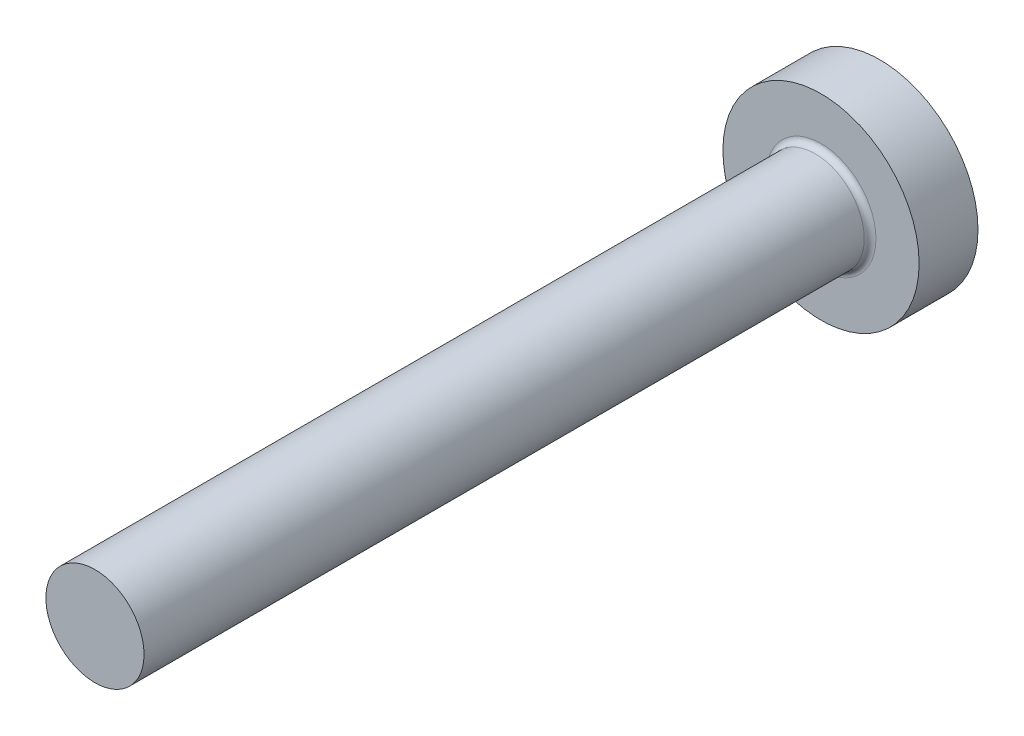
ISO-10303-21;
HEADER;
FILE_DESCRIPTION(('STEP AP214'),'2;1');
FILE_NAME('part.step','',(''),(''),'','','');
FILE_SCHEMA(('AUTOMOTIVE_DESIGN { 1 0 10303 214 1 1 1 1 }'));
ENDSEC;
DATA;
#1=APPLICATION_CONTEXT('core data for automotive mechanical design processes');
#2=APPLICATION_PROTOCOL_DEFINITION('international standard','automotive_design',2000,#1);
#3=PRODUCT_CONTEXT('',#1,'mechanical');
#4=PRODUCT('Part','Part','',(#3));
#5=PRODUCT_RELATED_PRODUCT_CATEGORY('part','',(#4));
#6=PRODUCT_DEFINITION_FORMATION('','',#4);
#7=PRODUCT_DEFINITION_CONTEXT('part definition',#1,'design');
#8=PRODUCT_DEFINITION('design','',#6,#7);
#9=PRODUCT_DEFINITION_SHAPE('','',#8);
#10=(LENGTH_UNIT() NAMED_UNIT(*) SI_UNIT(.MILLI.,.METRE.));
#11=(NAMED_UNIT(*) PLANE_ANGLE_UNIT() SI_UNIT($,.RADIAN.));
#12=(NAMED_UNIT(*) SI_UNIT($,.STERADIAN.) SOLID_ANGLE_UNIT());
#13=UNCERTAINTY_MEASURE_WITH_UNIT(LENGTH_MEASURE(1.E-05),#10,'distance_accuracy_value','');
#14=(GEOMETRIC_REPRESENTATION_CONTEXT(3) GLOBAL_UNCERTAINTY_ASSIGNED_CONTEXT((#13)) GLOBAL_UNIT_ASSIGNED_CONTEXT((#10,
#11,#12)) REPRESENTATION_CONTEXT('',''));
#15=CARTESIAN_POINT('',(0.,0.,0.));
#16=DIRECTION('',(0.,0.,1.));
#17=DIRECTION('',(1.,0.,0.));
#18=AXIS2_PLACEMENT_3D('',#15,#16,#17);
#19=CARTESIAN_POINT('',(0.,2.5,40.));
#20=DIRECTION('',(0.,0.,-1.));
#21=DIRECTION('',(-1.,0.,0.));
#22=AXIS2_PLACEMENT_3D('',#19,#20,#21);
#23=PLANE('',#22);
#24=CARTESIAN_POINT('',(0.,0.,40.));
#25=DIRECTION('',(0.,0.,1.));
#26=DIRECTION('',(1.,0.,0.));
#27=AXIS2_PLACEMENT_3D('',#24,#25,#26);
#28=CIRCLE('',#27,2.5);
#29=CARTESIAN_POINT('',(2.5,0.,40.));
#30=VERTEX_POINT('',#29);
#31=EDGE_CURVE('E10',#30,#30,#28,.T.);
#32=ORIENTED_EDGE('',*,*,#31,.T.);
#33=EDGE_LOOP('',(#32));
#34=FACE_BOUND('',#33,.T.);
#35=ADVANCED_FACE('F30',(#34),#23,.F.);
#36=CARTESIAN_POINT('',(0.,0.,0.));
#37=DIRECTION('',(0.,0.,1.));
#38=DIRECTION('',(1.,0.,0.));
#39=AXIS2_PLACEMENT_3D('',#36,#37,#38);
#40=CYLINDRICAL_SURFACE('',#39,2.5);
#41=ORIENTED_EDGE('',*,*,#31,.F.);
#42=EDGE_LOOP('',(#41));
#43=FACE_BOUND('',#42,.T.);
#44=CARTESIAN_POINT('',(0.,0.,3.3));
#45=DIRECTION('',(0.,0.,1.));
#46=DIRECTION('',(1.,0.,0.));
#47=AXIS2_PLACEMENT_3D('',#44,#45,#46);
#48=CIRCLE('',#47,2.5);
#49=CARTESIAN_POINT('',(2.5,0.,3.3));
#50=VERTEX_POINT('',#49);
#51=EDGE_CURVE('E36',#50,#50,#48,.T.);
#52=ORIENTED_EDGE('',*,*,#51,.T.);
#53=EDGE_LOOP('',(#52));
#54=FACE_BOUND('',#53,.T.);
#55=ADVANCED_FACE('F65',(#43,#54),#40,.T.);
#56=CARTESIAN_POINT('',(0.,0.,3.3));
#57=DIRECTION('',(0.,0.,1.));
#58=DIRECTION('',(1.,0.,0.));
#59=AXIS2_PLACEMENT_3D('',#56,#57,#58);
#60=TOROIDAL_SURFACE('',#59,2.8,0.3);
#61=ORIENTED_EDGE('',*,*,#51,.F.);
#62=EDGE_LOOP('',(#61));
#63=FACE_BOUND('',#62,.T.);
#64=CARTESIAN_POINT('',(0.,0.,3.));
#65=DIRECTION('',(0.,0.,1.));
#66=DIRECTION('',(1.,0.,0.));
#67=AXIS2_PLACEMENT_3D('',#64,#65,#66);
#68=CIRCLE('',#67,2.8);
#69=CARTESIAN_POINT('',(2.8,0.,3.));
#70=VERTEX_POINT('',#69);
#71=EDGE_CURVE('E40',#70,#70,#68,.T.);
#72=ORIENTED_EDGE('',*,*,#71,.T.);
#73=EDGE_LOOP('',(#72));
#74=FACE_BOUND('',#73,.T.);
#75=ADVANCED_FACE('F69',(#63,#74),#60,.F.);
#76=CARTESIAN_POINT('',(0.,5.,3.));
#77=DIRECTION('',(0.,0.,-1.));
#78=DIRECTION('',(-1.,0.,0.));
#79=AXIS2_PLACEMENT_3D('',#76,#77,#78);
#80=PLANE('',#79);
#81=ORIENTED_EDGE('',*,*,#71,.F.);
#82=EDGE_LOOP('',(#81));
#83=FACE_BOUND('',#82,.T.);
#84=CARTESIAN_POINT('',(0.,0.,3.));
#85=DIRECTION('',(0.,0.,1.));
#86=DIRECTION('',(1.,0.,0.));
#87=AXIS2_PLACEMENT_3D('',#84,#85,#86);
#88=CIRCLE('',#87,5.);
#89=CARTESIAN_POINT('',(5.,0.,3.));
#90=VERTEX_POINT('',#89);
#91=EDGE_CURVE('E44',#90,#90,#88,.T.);
#92=ORIENTED_EDGE('',*,*,#91,.T.);
#93=EDGE_LOOP('',(#92));
#94=FACE_BOUND('',#93,.T.);
#95=ADVANCED_FACE('F61',(#83,#94),#80,.F.);
#96=CARTESIAN_POINT('',(0.,0.,0.));
#97=DIRECTION('',(0.,0.,1.));
#98=DIRECTION('',(1.,0.,0.));
#99=AXIS2_PLACEMENT_3D('',#96,#97,#98);
#100=CYLINDRICAL_SURFACE('',#99,5.);
#101=ORIENTED_EDGE('',*,*,#91,.F.);
#102=EDGE_LOOP('',(#101));
#103=FACE_BOUND('',#102,.T.);
#104=CARTESIAN_POINT('',(0.,0.,0.));
#105=DIRECTION('',(0.,0.,1.));
#106=DIRECTION('',(1.,0.,0.));
#107=AXIS2_PLACEMENT_3D('',#104,#105,#106);
#108=CIRCLE('',#107,5.);
#109=CARTESIAN_POINT('',(5.,0.,0.));
#110=VERTEX_POINT('',#109);
#111=EDGE_CURVE('E49',#110,#110,#108,.T.);
#112=ORIENTED_EDGE('',*,*,#111,.T.);
#113=EDGE_LOOP('',(#112));
#114=FACE_BOUND('',#113,.T.);
#115=ADVANCED_FACE('F53',(#103,#114),#100,.T.);
#116=CARTESIAN_POINT('',(0.,0.,0.));
#117=DIRECTION('',(0.,0.,1.));
#118=DIRECTION('',(1.,0.,0.));
#119=AXIS2_PLACEMENT_3D('',#116,#117,#118);
#120=PLANE('',#119);
#121=ORIENTED_EDGE('',*,*,#111,.F.);
#122=EDGE_LOOP('',(#121));
#123=FACE_BOUND('',#122,.T.);
#124=ADVANCED_FACE('F55',(#123),#120,.F.);
#125=CLOSED_SHELL('',(#35,#55,#75,#95,#115,#124));
#126=MANIFOLD_SOLID_BREP('B2',#125);
#127=ADVANCED_BREP_SHAPE_REPRESENTATION('',(#18,#126),#14);
#128=SHAPE_DEFINITION_REPRESENTATION(#9,#127);
ENDSEC;
END-ISO-10303-21;
